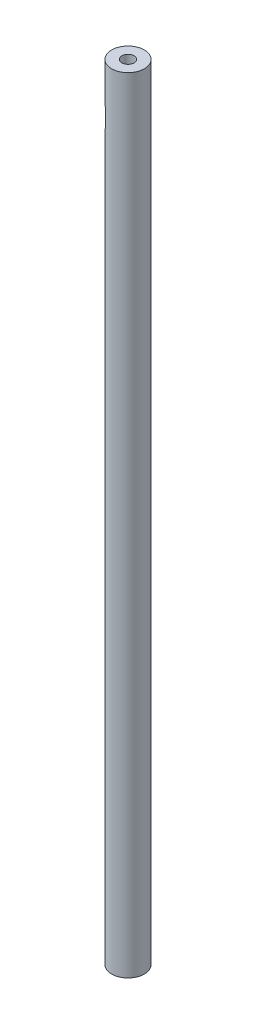
ISO-10303-21;
HEADER;
FILE_DESCRIPTION(('STEP AP214'),'2;1');
FILE_NAME('part.step','',(''),(''),'','','');
FILE_SCHEMA(('AUTOMOTIVE_DESIGN { 1 0 10303 214 1 1 1 1 }'));
ENDSEC;
DATA;
#1=APPLICATION_CONTEXT('core data for automotive mechanical design processes');
#2=APPLICATION_PROTOCOL_DEFINITION('international standard','automotive_design',2000,#1);
#3=PRODUCT_CONTEXT('',#1,'mechanical');
#4=PRODUCT('Part','Part','',(#3));
#5=PRODUCT_RELATED_PRODUCT_CATEGORY('part','',(#4));
#6=PRODUCT_DEFINITION_FORMATION('','',#4);
#7=PRODUCT_DEFINITION_CONTEXT('part definition',#1,'design');
#8=PRODUCT_DEFINITION('design','',#6,#7);
#9=PRODUCT_DEFINITION_SHAPE('','',#8);
#10=(LENGTH_UNIT() NAMED_UNIT(*) SI_UNIT(.MILLI.,.METRE.));
#11=(NAMED_UNIT(*) PLANE_ANGLE_UNIT() SI_UNIT($,.RADIAN.));
#12=(NAMED_UNIT(*) SI_UNIT($,.STERADIAN.) SOLID_ANGLE_UNIT());
#13=UNCERTAINTY_MEASURE_WITH_UNIT(LENGTH_MEASURE(1.E-05),#10,'distance_accuracy_value','');
#14=(GEOMETRIC_REPRESENTATION_CONTEXT(3) GLOBAL_UNCERTAINTY_ASSIGNED_CONTEXT((#13)) GLOBAL_UNIT_ASSIGNED_CONTEXT((#10,
#11,#12)) REPRESENTATION_CONTEXT('',''));
#15=CARTESIAN_POINT('',(0.,0.,0.));
#16=DIRECTION('',(0.,0.,1.));
#17=DIRECTION('',(1.,0.,0.));
#18=AXIS2_PLACEMENT_3D('',#15,#16,#17);
#19=CARTESIAN_POINT('',(0.,609.6,0.));
#20=DIRECTION('',(0.,1.,0.));
#21=DIRECTION('',(0.,0.,1.));
#22=AXIS2_PLACEMENT_3D('',#19,#20,#21);
#23=PLANE('',#22);
#24=CARTESIAN_POINT('',(0.,609.6,0.));
#25=DIRECTION('',(0.,1.,0.));
#26=DIRECTION('',(0.,0.,1.));
#27=AXIS2_PLACEMENT_3D('',#24,#25,#26);
#28=CIRCLE('',#27,12.7);
#29=CARTESIAN_POINT('',(0.,609.6,12.7));
#30=VERTEX_POINT('',#29);
#31=EDGE_CURVE('E87',#30,#30,#28,.T.);
#32=ORIENTED_EDGE('',*,*,#31,.T.);
#33=EDGE_LOOP('',(#32));
#34=FACE_BOUND('',#33,.T.);
#35=CARTESIAN_POINT('',(0.,609.6,0.));
#36=DIRECTION('',(0.,1.,0.));
#37=DIRECTION('',(0.,0.,1.));
#38=AXIS2_PLACEMENT_3D('',#35,#36,#37);
#39=CIRCLE('',#38,4.7625);
#40=CARTESIAN_POINT('',(0.,609.6,4.7625));
#41=VERTEX_POINT('',#40);
#42=EDGE_CURVE('E93',#41,#41,#39,.T.);
#43=ORIENTED_EDGE('',*,*,#42,.F.);
#44=EDGE_LOOP('',(#43));
#45=FACE_BOUND('',#44,.T.);
#46=ADVANCED_FACE('F48',(#34,#45),#23,.T.);
#47=CARTESIAN_POINT('',(0.,0.,0.));
#48=DIRECTION('',(0.,1.,0.));
#49=DIRECTION('',(0.,0.,1.));
#50=AXIS2_PLACEMENT_3D('',#47,#48,#49);
#51=PLANE('',#50);
#52=CARTESIAN_POINT('',(0.,0.,0.));
#53=DIRECTION('',(0.,1.,0.));
#54=DIRECTION('',(0.,0.,1.));
#55=AXIS2_PLACEMENT_3D('',#52,#53,#54);
#56=CIRCLE('',#55,12.7);
#57=CARTESIAN_POINT('',(0.,0.,12.7));
#58=VERTEX_POINT('',#57);
#59=EDGE_CURVE('E90',#58,#58,#56,.T.);
#60=ORIENTED_EDGE('',*,*,#59,.F.);
#61=EDGE_LOOP('',(#60));
#62=FACE_BOUND('',#61,.T.);
#63=CARTESIAN_POINT('',(0.,0.,0.));
#64=DIRECTION('',(0.,1.,0.));
#65=DIRECTION('',(0.,0.,1.));
#66=AXIS2_PLACEMENT_3D('',#63,#64,#65);
#67=CIRCLE('',#66,4.7625);
#68=CARTESIAN_POINT('',(0.,0.,4.7625));
#69=VERTEX_POINT('',#68);
#70=EDGE_CURVE('E83',#69,#69,#67,.T.);
#71=ORIENTED_EDGE('',*,*,#70,.T.);
#72=EDGE_LOOP('',(#71));
#73=FACE_BOUND('',#72,.T.);
#74=ADVANCED_FACE('F105',(#62,#73),#51,.F.);
#75=CARTESIAN_POINT('',(0.,609.6,0.));
#76=DIRECTION('',(0.,-1.,0.));
#77=DIRECTION('',(0.,0.,-1.));
#78=AXIS2_PLACEMENT_3D('',#75,#76,#77);
#79=CYLINDRICAL_SURFACE('',#78,12.7);
#80=DIRECTION('',(0.,-1.,0.));
#81=VECTOR('',#80,1.);
#82=CARTESIAN_POINT('',(-6.35,609.6,-10.9985226280624));
#83=LINE('',#82,#81);
#84=CARTESIAN_POINT('',(-6.35,578.104,-10.9985226280624));
#85=VERTEX_POINT('',#84);
#86=CARTESIAN_POINT('',(-6.35,565.404,-10.9985226280624));
#87=VERTEX_POINT('',#86);
#88=EDGE_CURVE('E13',#85,#87,#83,.T.);
#89=ORIENTED_EDGE('',*,*,#88,.F.);
#90=CARTESIAN_POINT('',(0.,571.754,0.));
#91=DIRECTION('',(-0.707106781186548,-0.707106781186547,0.));
#92=DIRECTION('',(0.707106781186548,-0.707106781186547,0.));
#93=AXIS2_PLACEMENT_3D('',#90,#91,#92);
#94=ELLIPSE('',#93,17.9605122421383,12.7);
#95=CARTESIAN_POINT('',(-6.35,578.104,10.9985226280624));
#96=VERTEX_POINT('',#95);
#97=EDGE_CURVE('E80',#85,#96,#94,.F.);
#98=ORIENTED_EDGE('',*,*,#97,.T.);
#99=DIRECTION('',(0.,-1.,0.));
#100=VECTOR('',#99,1.);
#101=CARTESIAN_POINT('',(-6.35,609.6,10.9985226280624));
#102=LINE('',#101,#100);
#103=CARTESIAN_POINT('',(-6.35,565.404,10.9985226280624));
#104=VERTEX_POINT('',#103);
#105=EDGE_CURVE('E56',#104,#96,#102,.F.);
#106=ORIENTED_EDGE('',*,*,#105,.F.);
#107=CARTESIAN_POINT('',(0.,571.754,0.));
#108=DIRECTION('',(0.707106781186548,-0.707106781186547,0.));
#109=DIRECTION('',(-0.707106781186548,-0.707106781186547,0.));
#110=AXIS2_PLACEMENT_3D('',#107,#108,#109);
#111=ELLIPSE('',#110,17.9605122421383,12.7);
#112=EDGE_CURVE('E62',#104,#87,#111,.T.);
#113=ORIENTED_EDGE('',*,*,#112,.T.);
#114=EDGE_LOOP('',(#89,#98,#106,#113));
#115=FACE_BOUND('',#114,.T.);
#116=ORIENTED_EDGE('',*,*,#31,.F.);
#117=EDGE_LOOP('',(#116));
#118=FACE_BOUND('',#117,.T.);
#119=ORIENTED_EDGE('',*,*,#59,.T.);
#120=EDGE_LOOP('',(#119));
#121=FACE_BOUND('',#120,.T.);
#122=ADVANCED_FACE('F50',(#115,#118,#121),#79,.T.);
#123=CARTESIAN_POINT('',(0.,609.6,0.));
#124=DIRECTION('',(0.,-1.,0.));
#125=DIRECTION('',(0.,0.,-1.));
#126=AXIS2_PLACEMENT_3D('',#123,#124,#125);
#127=CYLINDRICAL_SURFACE('',#126,4.7625);
#128=ORIENTED_EDGE('',*,*,#42,.T.);
#129=EDGE_LOOP('',(#128));
#130=FACE_BOUND('',#129,.T.);
#131=ORIENTED_EDGE('',*,*,#70,.F.);
#132=EDGE_LOOP('',(#131));
#133=FACE_BOUND('',#132,.T.);
#134=ADVANCED_FACE('F101',(#130,#133),#127,.F.);
#135=CARTESIAN_POINT('',(-6.35,571.754,0.));
#136=DIRECTION('',(-1.,0.,0.));
#137=DIRECTION('',(0.,0.,1.));
#138=AXIS2_PLACEMENT_3D('',#135,#136,#137);
#139=CYLINDRICAL_SURFACE('',#138,12.7);
#140=CARTESIAN_POINT('',(-6.35,571.754,0.));
#141=DIRECTION('',(-1.,0.,0.));
#142=DIRECTION('',(0.,0.,1.));
#143=AXIS2_PLACEMENT_3D('',#140,#141,#142);
#144=CIRCLE('',#143,12.7);
#145=EDGE_CURVE('E76',#96,#85,#144,.T.);
#146=ORIENTED_EDGE('',*,*,#145,.F.);
#147=ORIENTED_EDGE('',*,*,#97,.F.);
#148=EDGE_LOOP('',(#146,#147));
#149=FACE_BOUND('',#148,.T.);
#150=ADVANCED_FACE('F82',(#149),#139,.F.);
#151=EDGE_CURVE('E77',#87,#104,#144,.T.);
#152=ORIENTED_EDGE('',*,*,#151,.F.);
#153=ORIENTED_EDGE('',*,*,#112,.F.);
#154=EDGE_LOOP('',(#152,#153));
#155=FACE_BOUND('',#154,.T.);
#156=ADVANCED_FACE('F117',(#155),#139,.F.);
#157=CARTESIAN_POINT('',(-6.35,571.754,0.));
#158=DIRECTION('',(-1.,0.,0.));
#159=DIRECTION('',(0.,0.,1.));
#160=AXIS2_PLACEMENT_3D('',#157,#158,#159);
#161=PLANE('',#160);
#162=ORIENTED_EDGE('',*,*,#88,.T.);
#163=ORIENTED_EDGE('',*,*,#151,.T.);
#164=ORIENTED_EDGE('',*,*,#105,.T.);
#165=ORIENTED_EDGE('',*,*,#145,.T.);
#166=EDGE_LOOP('',(#162,#163,#164,#165));
#167=FACE_BOUND('',#166,.T.);
#168=ADVANCED_FACE('F75',(#167),#161,.T.);
#169=CLOSED_SHELL('',(#46,#74,#122,#134,#150,#156,#168));
#170=MANIFOLD_SOLID_BREP('B2',#169);
#171=ADVANCED_BREP_SHAPE_REPRESENTATION('',(#18,#170),#14);
#172=SHAPE_DEFINITION_REPRESENTATION(#9,#171);
ENDSEC;
END-ISO-10303-21;
